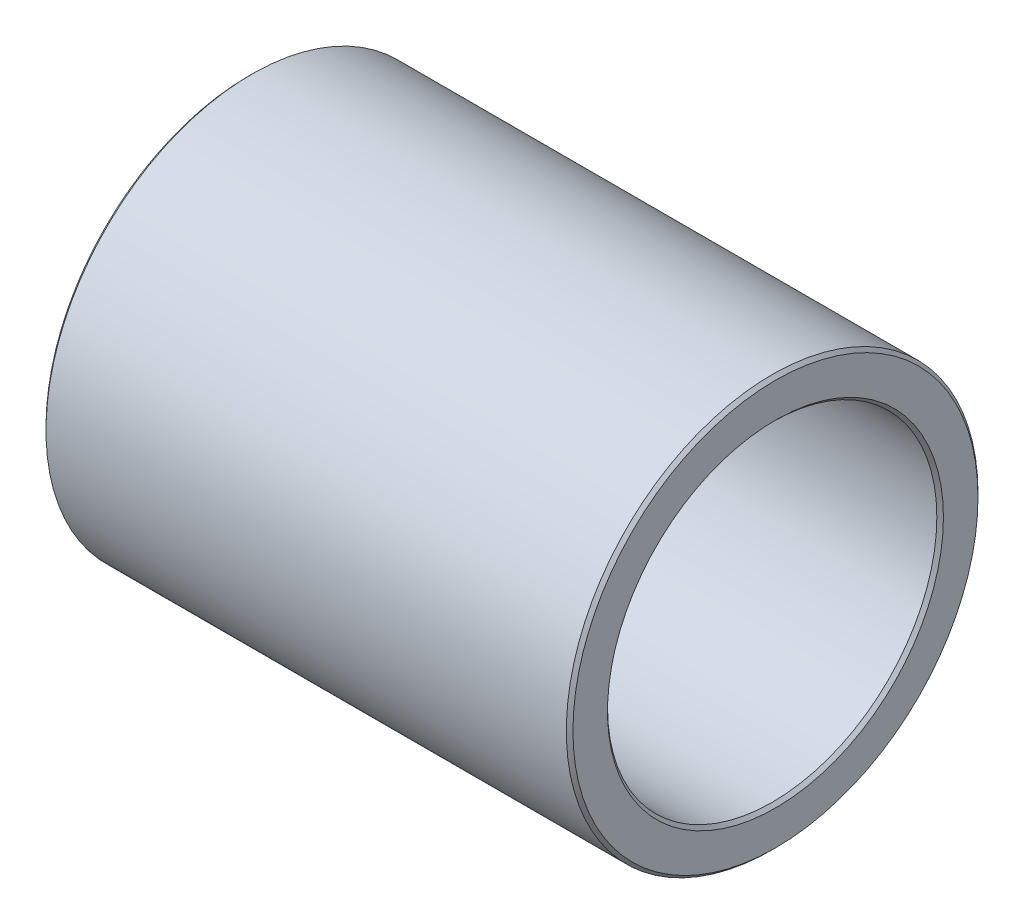
ISO-10303-21;
HEADER;
FILE_DESCRIPTION(('STEP AP214'),'2;1');
FILE_NAME('part.step','',(''),(''),'','','');
FILE_SCHEMA(('AUTOMOTIVE_DESIGN { 1 0 10303 214 1 1 1 1 }'));
ENDSEC;
DATA;
#1=APPLICATION_CONTEXT('core data for automotive mechanical design processes');
#2=APPLICATION_PROTOCOL_DEFINITION('international standard','automotive_design',2000,#1);
#3=PRODUCT_CONTEXT('',#1,'mechanical');
#4=PRODUCT('Part','Part','',(#3));
#5=PRODUCT_RELATED_PRODUCT_CATEGORY('part','',(#4));
#6=PRODUCT_DEFINITION_FORMATION('','',#4);
#7=PRODUCT_DEFINITION_CONTEXT('part definition',#1,'design');
#8=PRODUCT_DEFINITION('design','',#6,#7);
#9=PRODUCT_DEFINITION_SHAPE('','',#8);
#10=(LENGTH_UNIT() NAMED_UNIT(*) SI_UNIT(.MILLI.,.METRE.));
#11=(NAMED_UNIT(*) PLANE_ANGLE_UNIT() SI_UNIT($,.RADIAN.));
#12=(NAMED_UNIT(*) SI_UNIT($,.STERADIAN.) SOLID_ANGLE_UNIT());
#13=UNCERTAINTY_MEASURE_WITH_UNIT(LENGTH_MEASURE(1.E-05),#10,'distance_accuracy_value','');
#14=(GEOMETRIC_REPRESENTATION_CONTEXT(3) GLOBAL_UNCERTAINTY_ASSIGNED_CONTEXT((#13)) GLOBAL_UNIT_ASSIGNED_CONTEXT((#10,
#11,#12)) REPRESENTATION_CONTEXT('',''));
#15=CARTESIAN_POINT('',(0.,0.,0.));
#16=DIRECTION('',(0.,0.,1.));
#17=DIRECTION('',(1.,0.,0.));
#18=AXIS2_PLACEMENT_3D('',#15,#16,#17);
#19=CARTESIAN_POINT('',(40.64,0.,0.));
#20=DIRECTION('',(1.,0.,0.));
#21=DIRECTION('',(0.,0.,-1.));
#22=AXIS2_PLACEMENT_3D('',#19,#20,#21);
#23=PLANE('',#22);
#24=CARTESIAN_POINT('',(40.64,0.,0.));
#25=DIRECTION('',(1.,0.,0.));
#26=DIRECTION('',(0.,0.,-1.));
#27=AXIS2_PLACEMENT_3D('',#24,#25,#26);
#28=CIRCLE('',#27,12.954);
#29=CARTESIAN_POINT('',(40.64,0.,-12.954));
#30=VERTEX_POINT('',#29);
#31=EDGE_CURVE('E54',#30,#30,#28,.F.);
#32=ORIENTED_EDGE('',*,*,#31,.T.);
#33=EDGE_LOOP('',(#32));
#34=FACE_BOUND('',#33,.T.);
#35=CARTESIAN_POINT('',(40.64,0.,0.));
#36=DIRECTION('',(1.,0.,0.));
#37=DIRECTION('',(0.,0.,-1.));
#38=AXIS2_PLACEMENT_3D('',#35,#36,#37);
#39=CIRCLE('',#38,15.621);
#40=CARTESIAN_POINT('',(40.64,0.,-15.621));
#41=VERTEX_POINT('',#40);
#42=EDGE_CURVE('E57',#41,#41,#39,.T.);
#43=ORIENTED_EDGE('',*,*,#42,.T.);
#44=EDGE_LOOP('',(#43));
#45=FACE_BOUND('',#44,.T.);
#46=ADVANCED_FACE('F33',(#34,#45),#23,.T.);
#47=CARTESIAN_POINT('',(0.,0.,0.));
#48=DIRECTION('',(1.,0.,0.));
#49=DIRECTION('',(0.,0.,-1.));
#50=AXIS2_PLACEMENT_3D('',#47,#48,#49);
#51=PLANE('',#50);
#52=CARTESIAN_POINT('',(0.,0.,0.));
#53=DIRECTION('',(1.,0.,0.));
#54=DIRECTION('',(0.,0.,-1.));
#55=AXIS2_PLACEMENT_3D('',#52,#53,#54);
#56=CIRCLE('',#55,12.954);
#57=CARTESIAN_POINT('',(0.,0.,-12.954));
#58=VERTEX_POINT('',#57);
#59=EDGE_CURVE('E10',#58,#58,#56,.T.);
#60=ORIENTED_EDGE('',*,*,#59,.T.);
#61=EDGE_LOOP('',(#60));
#62=FACE_BOUND('',#61,.T.);
#63=CARTESIAN_POINT('',(0.,0.,0.));
#64=DIRECTION('',(1.,0.,0.));
#65=DIRECTION('',(0.,0.,-1.));
#66=AXIS2_PLACEMENT_3D('',#63,#64,#65);
#67=CIRCLE('',#66,15.621);
#68=CARTESIAN_POINT('',(0.,0.,-15.621));
#69=VERTEX_POINT('',#68);
#70=EDGE_CURVE('E41',#69,#69,#67,.F.);
#71=ORIENTED_EDGE('',*,*,#70,.T.);
#72=EDGE_LOOP('',(#71));
#73=FACE_BOUND('',#72,.T.);
#74=ADVANCED_FACE('F83',(#62,#73),#51,.F.);
#75=CARTESIAN_POINT('',(40.64,0.,0.));
#76=DIRECTION('',(-1.,0.,0.));
#77=DIRECTION('',(0.,0.,1.));
#78=AXIS2_PLACEMENT_3D('',#75,#76,#77);
#79=CYLINDRICAL_SURFACE('',#78,15.875);
#80=CARTESIAN_POINT('',(40.386,0.,0.));
#81=DIRECTION('',(1.,0.,0.));
#82=DIRECTION('',(0.,0.,-1.));
#83=AXIS2_PLACEMENT_3D('',#80,#81,#82);
#84=CIRCLE('',#83,15.875);
#85=CARTESIAN_POINT('',(40.386,0.,-15.875));
#86=VERTEX_POINT('',#85);
#87=EDGE_CURVE('E45',#86,#86,#84,.F.);
#88=ORIENTED_EDGE('',*,*,#87,.T.);
#89=EDGE_LOOP('',(#88));
#90=FACE_BOUND('',#89,.T.);
#91=CARTESIAN_POINT('',(0.253999999999997,0.,0.));
#92=DIRECTION('',(1.,0.,0.));
#93=DIRECTION('',(0.,0.,-1.));
#94=AXIS2_PLACEMENT_3D('',#91,#92,#93);
#95=CIRCLE('',#94,15.875);
#96=CARTESIAN_POINT('',(0.253999999999997,0.,-15.875));
#97=VERTEX_POINT('',#96);
#98=EDGE_CURVE('E49',#97,#97,#95,.T.);
#99=ORIENTED_EDGE('',*,*,#98,.T.);
#100=EDGE_LOOP('',(#99));
#101=FACE_BOUND('',#100,.T.);
#102=ADVANCED_FACE('F89',(#90,#101),#79,.T.);
#103=CARTESIAN_POINT('',(40.64,0.,0.));
#104=DIRECTION('',(-1.,0.,0.));
#105=DIRECTION('',(0.,0.,1.));
#106=AXIS2_PLACEMENT_3D('',#103,#104,#105);
#107=CYLINDRICAL_SURFACE('',#106,12.7);
#108=CARTESIAN_POINT('',(40.386,0.,0.));
#109=DIRECTION('',(1.,0.,0.));
#110=DIRECTION('',(0.,0.,-1.));
#111=AXIS2_PLACEMENT_3D('',#108,#109,#110);
#112=CIRCLE('',#111,12.7);
#113=CARTESIAN_POINT('',(40.386,0.,-12.7));
#114=VERTEX_POINT('',#113);
#115=EDGE_CURVE('E60',#114,#114,#112,.T.);
#116=ORIENTED_EDGE('',*,*,#115,.T.);
#117=EDGE_LOOP('',(#116));
#118=FACE_BOUND('',#117,.T.);
#119=CARTESIAN_POINT('',(0.254000000000004,0.,0.));
#120=DIRECTION('',(1.,0.,0.));
#121=DIRECTION('',(0.,0.,-1.));
#122=AXIS2_PLACEMENT_3D('',#119,#120,#121);
#123=CIRCLE('',#122,12.7);
#124=CARTESIAN_POINT('',(0.254000000000004,0.,-12.7));
#125=VERTEX_POINT('',#124);
#126=EDGE_CURVE('E63',#125,#125,#123,.F.);
#127=ORIENTED_EDGE('',*,*,#126,.T.);
#128=EDGE_LOOP('',(#127));
#129=FACE_BOUND('',#128,.T.);
#130=ADVANCED_FACE('F67',(#118,#129),#107,.F.);
#131=CARTESIAN_POINT('',(40.386,0.,0.));
#132=DIRECTION('',(1.,0.,0.));
#133=DIRECTION('',(0.,0.,-1.));
#134=AXIS2_PLACEMENT_3D('',#131,#132,#133);
#135=CONICAL_SURFACE('',#134,12.7,0.785398163397442);
#136=ORIENTED_EDGE('',*,*,#31,.F.);
#137=EDGE_LOOP('',(#136));
#138=FACE_BOUND('',#137,.T.);
#139=ORIENTED_EDGE('',*,*,#115,.F.);
#140=EDGE_LOOP('',(#139));
#141=FACE_BOUND('',#140,.T.);
#142=ADVANCED_FACE('F78',(#138,#141),#135,.F.);
#143=CARTESIAN_POINT('',(40.64,0.,0.));
#144=DIRECTION('',(-1.,0.,0.));
#145=DIRECTION('',(0.,0.,1.));
#146=AXIS2_PLACEMENT_3D('',#143,#144,#145);
#147=CONICAL_SURFACE('',#146,15.621,0.785398163397428);
#148=ORIENTED_EDGE('',*,*,#87,.F.);
#149=EDGE_LOOP('',(#148));
#150=FACE_BOUND('',#149,.T.);
#151=ORIENTED_EDGE('',*,*,#42,.F.);
#152=EDGE_LOOP('',(#151));
#153=FACE_BOUND('',#152,.T.);
#154=ADVANCED_FACE('F72',(#150,#153),#147,.T.);
#155=CARTESIAN_POINT('',(0.,0.,0.));
#156=DIRECTION('',(-1.,0.,0.));
#157=DIRECTION('',(0.,0.,1.));
#158=AXIS2_PLACEMENT_3D('',#155,#156,#157);
#159=CONICAL_SURFACE('',#158,12.954,0.785398163397431);
#160=ORIENTED_EDGE('',*,*,#126,.F.);
#161=EDGE_LOOP('',(#160));
#162=FACE_BOUND('',#161,.T.);
#163=ORIENTED_EDGE('',*,*,#59,.F.);
#164=EDGE_LOOP('',(#163));
#165=FACE_BOUND('',#164,.T.);
#166=ADVANCED_FACE('F69',(#162,#165),#159,.F.);
#167=CARTESIAN_POINT('',(0.253999999999997,0.,0.));
#168=DIRECTION('',(1.,0.,0.));
#169=DIRECTION('',(0.,0.,-1.));
#170=AXIS2_PLACEMENT_3D('',#167,#168,#169);
#171=CONICAL_SURFACE('',#170,15.875,0.785398163397455);
#172=ORIENTED_EDGE('',*,*,#70,.F.);
#173=EDGE_LOOP('',(#172));
#174=FACE_BOUND('',#173,.T.);
#175=ORIENTED_EDGE('',*,*,#98,.F.);
#176=EDGE_LOOP('',(#175));
#177=FACE_BOUND('',#176,.T.);
#178=ADVANCED_FACE('F36',(#174,#177),#171,.T.);
#179=CLOSED_SHELL('',(#46,#74,#102,#130,#142,#154,#166,#178));
#180=MANIFOLD_SOLID_BREP('B2',#179);
#181=ADVANCED_BREP_SHAPE_REPRESENTATION('',(#18,#180),#14);
#182=SHAPE_DEFINITION_REPRESENTATION(#9,#181);
ENDSEC;
END-ISO-10303-21;
